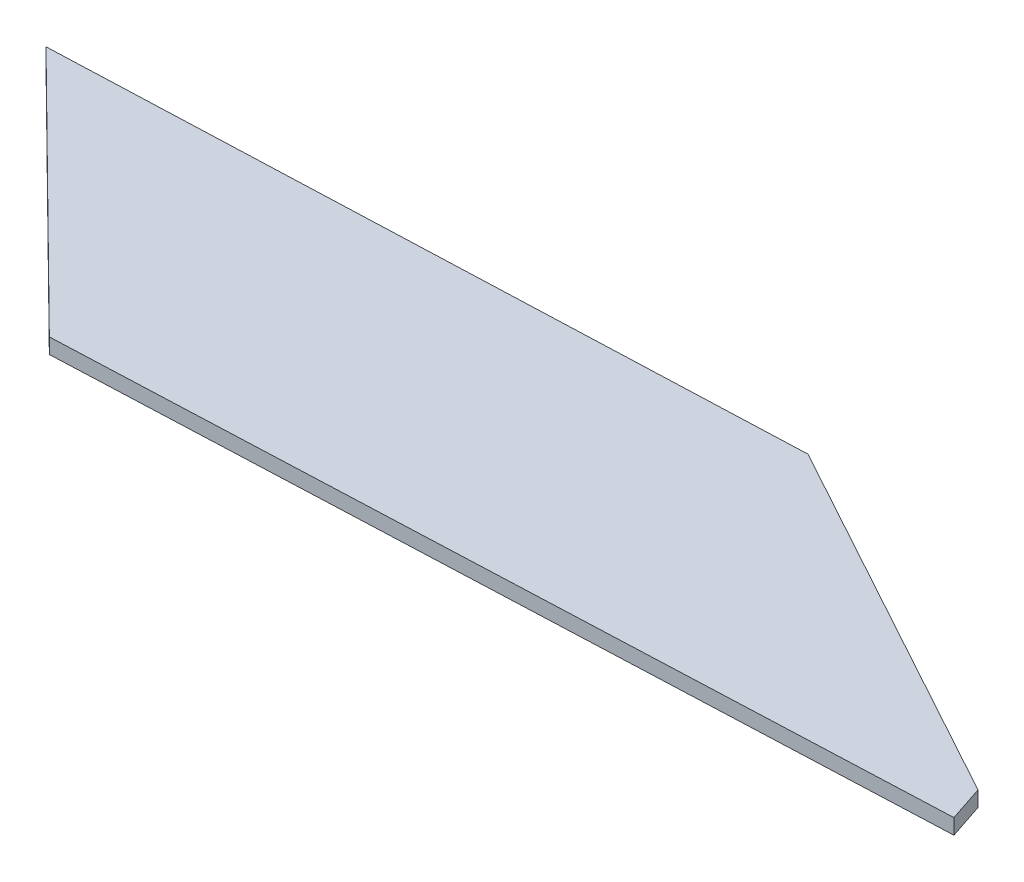
ISO-10303-21;
HEADER;
FILE_DESCRIPTION(('STEP AP214'),'2;1');
FILE_NAME('part.step','',(''),(''),'','','');
FILE_SCHEMA(('AUTOMOTIVE_DESIGN { 1 0 10303 214 1 1 1 1 }'));
ENDSEC;
DATA;
#1=APPLICATION_CONTEXT('core data for automotive mechanical design processes');
#2=APPLICATION_PROTOCOL_DEFINITION('international standard','automotive_design',2000,#1);
#3=PRODUCT_CONTEXT('',#1,'mechanical');
#4=PRODUCT('Part','Part','',(#3));
#5=PRODUCT_RELATED_PRODUCT_CATEGORY('part','',(#4));
#6=PRODUCT_DEFINITION_FORMATION('','',#4);
#7=PRODUCT_DEFINITION_CONTEXT('part definition',#1,'design');
#8=PRODUCT_DEFINITION('design','',#6,#7);
#9=PRODUCT_DEFINITION_SHAPE('','',#8);
#10=(LENGTH_UNIT() NAMED_UNIT(*) SI_UNIT(.MILLI.,.METRE.));
#11=(NAMED_UNIT(*) PLANE_ANGLE_UNIT() SI_UNIT($,.RADIAN.));
#12=(NAMED_UNIT(*) SI_UNIT($,.STERADIAN.) SOLID_ANGLE_UNIT());
#13=UNCERTAINTY_MEASURE_WITH_UNIT(LENGTH_MEASURE(1.E-05),#10,'distance_accuracy_value','');
#14=(GEOMETRIC_REPRESENTATION_CONTEXT(3) GLOBAL_UNCERTAINTY_ASSIGNED_CONTEXT((#13)) GLOBAL_UNIT_ASSIGNED_CONTEXT((#10,
#11,#12)) REPRESENTATION_CONTEXT('',''));
#15=CARTESIAN_POINT('',(0.,0.,0.));
#16=DIRECTION('',(0.,0.,1.));
#17=DIRECTION('',(1.,0.,0.));
#18=AXIS2_PLACEMENT_3D('',#15,#16,#17);
#19=CARTESIAN_POINT('',(113.738429410003,2.,-4.71750065238213));
#20=DIRECTION('',(-0.949198822453294,0.,0.314676970007783));
#21=DIRECTION('',(0.314676970007783,0.,0.949198822453294));
#22=AXIS2_PLACEMENT_3D('',#19,#20,#21);
#23=PLANE('',#22);
#24=DIRECTION('',(-0.314676970007783,0.,-0.949198822453294));
#25=VECTOR('',#24,1.);
#26=CARTESIAN_POINT('',(113.738429410003,0.,-4.71750065238213));
#27=LINE('',#26,#25);
#28=CARTESIAN_POINT('',(113.738429410003,0.,-4.71750065238213));
#29=VERTEX_POINT('',#28);
#30=CARTESIAN_POINT('',(112.175529537033,0.,-9.43186763958032));
#31=VERTEX_POINT('',#30);
#32=EDGE_CURVE('E118',#29,#31,#27,.T.);
#33=ORIENTED_EDGE('',*,*,#32,.T.);
#34=DIRECTION('',(0.,-1.,0.));
#35=VECTOR('',#34,1.);
#36=CARTESIAN_POINT('',(112.175529537033,2.,-9.43186763958032));
#37=LINE('',#36,#35);
#38=CARTESIAN_POINT('',(112.175529537033,2.,-9.43186763958032));
#39=VERTEX_POINT('',#38);
#40=EDGE_CURVE('E11',#39,#31,#37,.T.);
#41=ORIENTED_EDGE('',*,*,#40,.F.);
#42=DIRECTION('',(-0.314676970007783,0.,-0.949198822453294));
#43=VECTOR('',#42,1.);
#44=CARTESIAN_POINT('',(113.738429410003,2.,-4.71750065238213));
#45=LINE('',#44,#43);
#46=CARTESIAN_POINT('',(113.738429410003,2.,-4.71750065238213));
#47=VERTEX_POINT('',#46);
#48=EDGE_CURVE('E131',#47,#39,#45,.T.);
#49=ORIENTED_EDGE('',*,*,#48,.F.);
#50=DIRECTION('',(0.,-1.,0.));
#51=VECTOR('',#50,1.);
#52=CARTESIAN_POINT('',(113.738429410003,2.,-4.71750065238213));
#53=LINE('',#52,#51);
#54=EDGE_CURVE('E114',#47,#29,#53,.T.);
#55=ORIENTED_EDGE('',*,*,#54,.T.);
#56=EDGE_LOOP('',(#33,#41,#49,#55));
#57=FACE_BOUND('',#56,.T.);
#58=ADVANCED_FACE('F39',(#57),#23,.F.);
#59=CARTESIAN_POINT('',(112.175529537033,2.,-9.43186763958032));
#60=DIRECTION('',(-0.480289086696222,0.,0.877110251451041));
#61=DIRECTION('',(0.877110251451041,0.,0.480289086696222));
#62=AXIS2_PLACEMENT_3D('',#59,#60,#61);
#63=PLANE('',#62);
#64=DIRECTION('',(-0.877110251451041,0.,-0.480289086696222));
#65=VECTOR('',#64,1.);
#66=CARTESIAN_POINT('',(112.175529537033,0.,-9.43186763958032));
#67=LINE('',#66,#65);
#68=CARTESIAN_POINT('',(62.9646005658762,0.,-36.3788473287678));
#69=VERTEX_POINT('',#68);
#70=EDGE_CURVE('E122',#31,#69,#67,.T.);
#71=ORIENTED_EDGE('',*,*,#70,.T.);
#72=DIRECTION('',(0.,-1.,0.));
#73=VECTOR('',#72,1.);
#74=CARTESIAN_POINT('',(62.9646005658762,2.,-36.3788473287678));
#75=LINE('',#74,#73);
#76=CARTESIAN_POINT('',(62.9646005658762,2.,-36.3788473287678));
#77=VERTEX_POINT('',#76);
#78=EDGE_CURVE('E48',#77,#69,#75,.T.);
#79=ORIENTED_EDGE('',*,*,#78,.F.);
#80=DIRECTION('',(-0.877110251451041,0.,-0.480289086696222));
#81=VECTOR('',#80,1.);
#82=CARTESIAN_POINT('',(112.175529537033,2.,-9.43186763958032));
#83=LINE('',#82,#81);
#84=EDGE_CURVE('E90',#39,#77,#83,.T.);
#85=ORIENTED_EDGE('',*,*,#84,.F.);
#86=ORIENTED_EDGE('',*,*,#40,.T.);
#87=EDGE_LOOP('',(#71,#79,#85,#86));
#88=FACE_BOUND('',#87,.T.);
#89=ADVANCED_FACE('F153',(#88),#63,.F.);
#90=CARTESIAN_POINT('',(62.9646005658762,2.,-36.3788473287678));
#91=DIRECTION('',(0.0384167081510389,0.,0.999261805802082));
#92=DIRECTION('',(0.999261805802082,0.,-0.0384167081510389));
#93=AXIS2_PLACEMENT_3D('',#90,#91,#92);
#94=PLANE('',#93);
#95=DIRECTION('',(-0.999261805802082,0.,0.0384167081510389));
#96=VECTOR('',#95,1.);
#97=CARTESIAN_POINT('',(62.9646005658762,0.,-36.3788473287678));
#98=LINE('',#97,#96);
#99=CARTESIAN_POINT('',(-33.1220683192241,0.,-32.6847868790126));
#100=VERTEX_POINT('',#99);
#101=EDGE_CURVE('E106',#69,#100,#98,.T.);
#102=ORIENTED_EDGE('',*,*,#101,.T.);
#103=DIRECTION('',(0.,-1.,0.));
#104=VECTOR('',#103,1.);
#105=CARTESIAN_POINT('',(-33.1220683192241,2.,-32.6847868790126));
#106=LINE('',#105,#104);
#107=CARTESIAN_POINT('',(-33.1220683192241,2.,-32.6847868790126));
#108=VERTEX_POINT('',#107);
#109=EDGE_CURVE('E103',#108,#100,#106,.T.);
#110=ORIENTED_EDGE('',*,*,#109,.F.);
#111=DIRECTION('',(-0.999261805802082,0.,0.0384167081510389));
#112=VECTOR('',#111,1.);
#113=CARTESIAN_POINT('',(62.9646005658762,2.,-36.3788473287678));
#114=LINE('',#113,#112);
#115=EDGE_CURVE('E94',#77,#108,#114,.T.);
#116=ORIENTED_EDGE('',*,*,#115,.F.);
#117=ORIENTED_EDGE('',*,*,#78,.T.);
#118=EDGE_LOOP('',(#102,#110,#116,#117));
#119=FACE_BOUND('',#118,.T.);
#120=ADVANCED_FACE('F104',(#119),#94,.F.);
#121=CARTESIAN_POINT('',(-33.1220683192241,2.,-32.6847868790126));
#122=DIRECTION('',(0.702392604662266,0.,-0.711789736450139));
#123=DIRECTION('',(-0.711789736450139,0.,-0.702392604662266));
#124=AXIS2_PLACEMENT_3D('',#121,#122,#123);
#125=PLANE('',#124);
#126=DIRECTION('',(0.711789736450139,0.,0.702392604662266));
#127=VECTOR('',#126,1.);
#128=CARTESIAN_POINT('',(-33.1220683192241,0.,-32.6847868790126));
#129=LINE('',#128,#127);
#130=CARTESIAN_POINT('',(0.,0.,0.));
#131=VERTEX_POINT('',#130);
#132=EDGE_CURVE('E76',#100,#131,#129,.T.);
#133=ORIENTED_EDGE('',*,*,#132,.T.);
#134=DIRECTION('',(0.,-1.,0.));
#135=VECTOR('',#134,1.);
#136=CARTESIAN_POINT('',(0.,2.,0.));
#137=LINE('',#136,#135);
#138=CARTESIAN_POINT('',(0.,2.,0.));
#139=VERTEX_POINT('',#138);
#140=EDGE_CURVE('E108',#139,#131,#137,.T.);
#141=ORIENTED_EDGE('',*,*,#140,.F.);
#142=DIRECTION('',(0.711789736450139,0.,0.702392604662266));
#143=VECTOR('',#142,1.);
#144=CARTESIAN_POINT('',(-33.1220683192241,2.,-32.6847868790126));
#145=LINE('',#144,#143);
#146=EDGE_CURVE('E98',#108,#139,#145,.T.);
#147=ORIENTED_EDGE('',*,*,#146,.F.);
#148=ORIENTED_EDGE('',*,*,#109,.T.);
#149=EDGE_LOOP('',(#133,#141,#147,#148));
#150=FACE_BOUND('',#149,.T.);
#151=ADVANCED_FACE('F110',(#150),#125,.F.);
#152=CARTESIAN_POINT('',(0.,2.,0.));
#153=DIRECTION('',(-0.0414411215033475,0.,-0.999140947738879));
#154=DIRECTION('',(-0.999140947738879,0.,0.0414411215033475));
#155=AXIS2_PLACEMENT_3D('',#152,#153,#154);
#156=PLANE('',#155);
#157=DIRECTION('',(0.999140947738879,0.,-0.0414411215033475));
#158=VECTOR('',#157,1.);
#159=CARTESIAN_POINT('',(0.,0.,0.));
#160=LINE('',#159,#158);
#161=EDGE_CURVE('E82',#131,#29,#160,.T.);
#162=ORIENTED_EDGE('',*,*,#161,.T.);
#163=ORIENTED_EDGE('',*,*,#54,.F.);
#164=DIRECTION('',(0.999140947738879,0.,-0.0414411215033475));
#165=VECTOR('',#164,1.);
#166=CARTESIAN_POINT('',(0.,2.,0.));
#167=LINE('',#166,#165);
#168=EDGE_CURVE('E56',#139,#47,#167,.T.);
#169=ORIENTED_EDGE('',*,*,#168,.F.);
#170=ORIENTED_EDGE('',*,*,#140,.T.);
#171=EDGE_LOOP('',(#162,#163,#169,#170));
#172=FACE_BOUND('',#171,.T.);
#173=ADVANCED_FACE('F142',(#172),#156,.F.);
#174=CARTESIAN_POINT('',(0.,2.,0.));
#175=DIRECTION('',(0.,-1.,0.));
#176=DIRECTION('',(0.,0.,-1.));
#177=AXIS2_PLACEMENT_3D('',#174,#175,#176);
#178=PLANE('',#177);
#179=ORIENTED_EDGE('',*,*,#48,.T.);
#180=ORIENTED_EDGE('',*,*,#84,.T.);
#181=ORIENTED_EDGE('',*,*,#115,.T.);
#182=ORIENTED_EDGE('',*,*,#146,.T.);
#183=ORIENTED_EDGE('',*,*,#168,.T.);
#184=EDGE_LOOP('',(#179,#180,#181,#182,#183));
#185=FACE_BOUND('',#184,.T.);
#186=ADVANCED_FACE('F96',(#185),#178,.F.);
#187=CARTESIAN_POINT('',(0.,0.,0.));
#188=DIRECTION('',(0.,-1.,0.));
#189=DIRECTION('',(0.,0.,-1.));
#190=AXIS2_PLACEMENT_3D('',#187,#188,#189);
#191=PLANE('',#190);
#192=ORIENTED_EDGE('',*,*,#32,.F.);
#193=ORIENTED_EDGE('',*,*,#161,.F.);
#194=ORIENTED_EDGE('',*,*,#132,.F.);
#195=ORIENTED_EDGE('',*,*,#101,.F.);
#196=ORIENTED_EDGE('',*,*,#70,.F.);
#197=EDGE_LOOP('',(#192,#193,#194,#195,#196));
#198=FACE_BOUND('',#197,.T.);
#199=ADVANCED_FACE('F138',(#198),#191,.T.);
#200=CLOSED_SHELL('',(#58,#89,#120,#151,#173,#186,#199));
#201=MANIFOLD_SOLID_BREP('B2',#200);
#202=ADVANCED_BREP_SHAPE_REPRESENTATION('',(#18,#201),#14);
#203=SHAPE_DEFINITION_REPRESENTATION(#9,#202);
ENDSEC;
END-ISO-10303-21;
